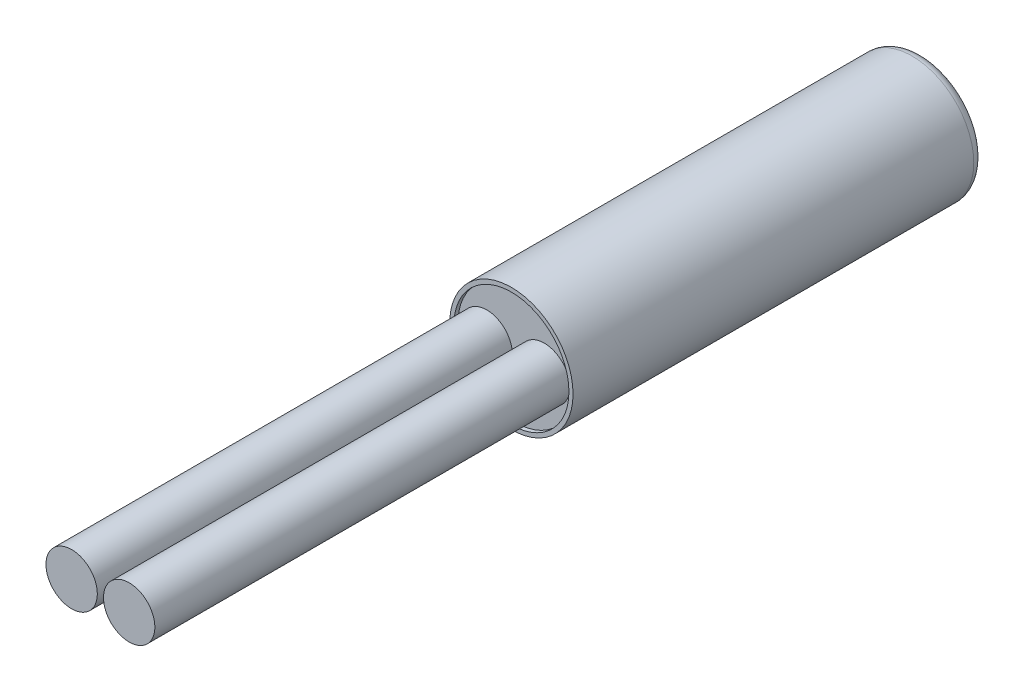
ISO-10303-21;
HEADER;
FILE_DESCRIPTION(('STEP AP214'),'2;1');
FILE_NAME('part.step','',(''),(''),'','','');
FILE_SCHEMA(('AUTOMOTIVE_DESIGN { 1 0 10303 214 1 1 1 1 }'));
ENDSEC;
DATA;
#1=APPLICATION_CONTEXT('core data for automotive mechanical design processes');
#2=APPLICATION_PROTOCOL_DEFINITION('international standard','automotive_design',2000,#1);
#3=PRODUCT_CONTEXT('',#1,'mechanical');
#4=PRODUCT('Part','Part','',(#3));
#5=PRODUCT_RELATED_PRODUCT_CATEGORY('part','',(#4));
#6=PRODUCT_DEFINITION_FORMATION('','',#4);
#7=PRODUCT_DEFINITION_CONTEXT('part definition',#1,'design');
#8=PRODUCT_DEFINITION('design','',#6,#7);
#9=PRODUCT_DEFINITION_SHAPE('','',#8);
#10=(LENGTH_UNIT() NAMED_UNIT(*) SI_UNIT(.MILLI.,.METRE.));
#11=(NAMED_UNIT(*) PLANE_ANGLE_UNIT() SI_UNIT($,.RADIAN.));
#12=(NAMED_UNIT(*) SI_UNIT($,.STERADIAN.) SOLID_ANGLE_UNIT());
#13=UNCERTAINTY_MEASURE_WITH_UNIT(LENGTH_MEASURE(1.E-05),#10,'distance_accuracy_value','');
#14=(GEOMETRIC_REPRESENTATION_CONTEXT(3) GLOBAL_UNCERTAINTY_ASSIGNED_CONTEXT((#13)) GLOBAL_UNIT_ASSIGNED_CONTEXT((#10,
#11,#12)) REPRESENTATION_CONTEXT('',''));
#15=CARTESIAN_POINT('',(0.,0.,0.));
#16=DIRECTION('',(0.,0.,1.));
#17=DIRECTION('',(1.,0.,0.));
#18=AXIS2_PLACEMENT_3D('',#15,#16,#17);
#19=CARTESIAN_POINT('',(0.,0.,20.));
#20=DIRECTION('',(0.,0.,-1.));
#21=DIRECTION('',(-1.,0.,0.));
#22=AXIS2_PLACEMENT_3D('',#19,#20,#21);
#23=CYLINDRICAL_SURFACE('',#22,3.);
#24=CARTESIAN_POINT('',(0.,0.,0.5));
#25=DIRECTION('',(0.,0.,1.));
#26=DIRECTION('',(1.,0.,0.));
#27=AXIS2_PLACEMENT_3D('',#24,#25,#26);
#28=CIRCLE('',#27,3.);
#29=CARTESIAN_POINT('',(3.,0.,0.5));
#30=VERTEX_POINT('',#29);
#31=EDGE_CURVE('E48',#30,#30,#28,.T.);
#32=ORIENTED_EDGE('',*,*,#31,.T.);
#33=EDGE_LOOP('',(#32));
#34=FACE_BOUND('',#33,.T.);
#35=CARTESIAN_POINT('',(0.,0.,20.));
#36=DIRECTION('',(0.,0.,1.));
#37=DIRECTION('',(1.,0.,0.));
#38=AXIS2_PLACEMENT_3D('',#35,#36,#37);
#39=CIRCLE('',#38,3.);
#40=CARTESIAN_POINT('',(3.,0.,20.));
#41=VERTEX_POINT('',#40);
#42=EDGE_CURVE('E52',#41,#41,#39,.T.);
#43=ORIENTED_EDGE('',*,*,#42,.F.);
#44=EDGE_LOOP('',(#43));
#45=FACE_BOUND('',#44,.T.);
#46=ADVANCED_FACE('F41',(#34,#45),#23,.T.);
#47=CARTESIAN_POINT('',(0.,0.,20.));
#48=DIRECTION('',(0.,0.,1.));
#49=DIRECTION('',(1.,0.,0.));
#50=AXIS2_PLACEMENT_3D('',#47,#48,#49);
#51=PLANE('',#50);
#52=CARTESIAN_POINT('',(0.,0.,20.));
#53=DIRECTION('',(0.,0.,1.));
#54=DIRECTION('',(1.,0.,0.));
#55=AXIS2_PLACEMENT_3D('',#52,#53,#54);
#56=CIRCLE('',#55,2.8);
#57=CARTESIAN_POINT('',(2.8,0.,20.));
#58=VERTEX_POINT('',#57);
#59=EDGE_CURVE('E59',#58,#58,#56,.T.);
#60=ORIENTED_EDGE('',*,*,#59,.F.);
#61=EDGE_LOOP('',(#60));
#62=FACE_BOUND('',#61,.T.);
#63=ORIENTED_EDGE('',*,*,#42,.T.);
#64=EDGE_LOOP('',(#63));
#65=FACE_BOUND('',#64,.T.);
#66=ADVANCED_FACE('F94',(#62,#65),#51,.T.);
#67=CARTESIAN_POINT('',(0.,0.,0.));
#68=DIRECTION('',(0.,0.,1.));
#69=DIRECTION('',(1.,0.,0.));
#70=AXIS2_PLACEMENT_3D('',#67,#68,#69);
#71=PLANE('',#70);
#72=CARTESIAN_POINT('',(0.,0.,0.));
#73=DIRECTION('',(0.,0.,1.));
#74=DIRECTION('',(1.,0.,0.));
#75=AXIS2_PLACEMENT_3D('',#72,#73,#74);
#76=CIRCLE('',#75,2.5);
#77=CARTESIAN_POINT('',(2.5,0.,0.));
#78=VERTEX_POINT('',#77);
#79=EDGE_CURVE('E10',#78,#78,#76,.F.);
#80=ORIENTED_EDGE('',*,*,#79,.T.);
#81=EDGE_LOOP('',(#80));
#82=FACE_BOUND('',#81,.T.);
#83=ADVANCED_FACE('F97',(#82),#71,.F.);
#84=CARTESIAN_POINT('',(0.,0.,0.5));
#85=DIRECTION('',(0.,0.,1.));
#86=DIRECTION('',(1.,0.,0.));
#87=AXIS2_PLACEMENT_3D('',#84,#85,#86);
#88=TOROIDAL_SURFACE('',#87,2.5,0.5);
#89=ORIENTED_EDGE('',*,*,#79,.F.);
#90=EDGE_LOOP('',(#89));
#91=FACE_BOUND('',#90,.T.);
#92=ORIENTED_EDGE('',*,*,#31,.F.);
#93=EDGE_LOOP('',(#92));
#94=FACE_BOUND('',#93,.T.);
#95=ADVANCED_FACE('F43',(#91,#94),#88,.T.);
#96=CARTESIAN_POINT('',(0.,0.,19.8));
#97=DIRECTION('',(0.,0.,1.));
#98=DIRECTION('',(1.,0.,0.));
#99=AXIS2_PLACEMENT_3D('',#96,#97,#98);
#100=CYLINDRICAL_SURFACE('',#99,2.8);
#101=CARTESIAN_POINT('',(0.,0.,19.8));
#102=DIRECTION('',(0.,0.,1.));
#103=DIRECTION('',(1.,0.,0.));
#104=AXIS2_PLACEMENT_3D('',#101,#102,#103);
#105=CIRCLE('',#104,2.8);
#106=CARTESIAN_POINT('',(2.8,0.,19.8));
#107=VERTEX_POINT('',#106);
#108=EDGE_CURVE('E56',#107,#107,#105,.T.);
#109=ORIENTED_EDGE('',*,*,#108,.F.);
#110=EDGE_LOOP('',(#109));
#111=FACE_BOUND('',#110,.T.);
#112=ORIENTED_EDGE('',*,*,#59,.T.);
#113=EDGE_LOOP('',(#112));
#114=FACE_BOUND('',#113,.T.);
#115=ADVANCED_FACE('F83',(#111,#114),#100,.F.);
#116=CARTESIAN_POINT('',(0.,0.,19.8));
#117=DIRECTION('',(0.,0.,1.));
#118=DIRECTION('',(1.,0.,0.));
#119=AXIS2_PLACEMENT_3D('',#116,#117,#118);
#120=PLANE('',#119);
#121=CARTESIAN_POINT('',(1.4,0.,19.8));
#122=DIRECTION('',(0.,0.,1.));
#123=DIRECTION('',(1.,0.,0.));
#124=AXIS2_PLACEMENT_3D('',#121,#122,#123);
#125=CIRCLE('',#124,1.25);
#126=CARTESIAN_POINT('',(2.65,0.,19.8));
#127=VERTEX_POINT('',#126);
#128=EDGE_CURVE('E68',#127,#127,#125,.T.);
#129=ORIENTED_EDGE('',*,*,#128,.F.);
#130=EDGE_LOOP('',(#129));
#131=FACE_BOUND('',#130,.T.);
#132=CARTESIAN_POINT('',(-1.4,0.,19.8));
#133=DIRECTION('',(0.,0.,1.));
#134=DIRECTION('',(1.,0.,0.));
#135=AXIS2_PLACEMENT_3D('',#132,#133,#134);
#136=CIRCLE('',#135,1.25);
#137=CARTESIAN_POINT('',(-0.15,0.,19.8));
#138=VERTEX_POINT('',#137);
#139=EDGE_CURVE('E65',#138,#138,#136,.T.);
#140=ORIENTED_EDGE('',*,*,#139,.F.);
#141=EDGE_LOOP('',(#140));
#142=FACE_BOUND('',#141,.T.);
#143=ORIENTED_EDGE('',*,*,#108,.T.);
#144=EDGE_LOOP('',(#143));
#145=FACE_BOUND('',#144,.T.);
#146=ADVANCED_FACE('F79',(#131,#142,#145),#120,.T.);
#147=CARTESIAN_POINT('',(-1.4,0.,40.));
#148=DIRECTION('',(0.,0.,-1.));
#149=DIRECTION('',(-1.,0.,0.));
#150=AXIS2_PLACEMENT_3D('',#147,#148,#149);
#151=CYLINDRICAL_SURFACE('',#150,1.25);
#152=CARTESIAN_POINT('',(-1.4,0.,40.));
#153=DIRECTION('',(0.,0.,1.));
#154=DIRECTION('',(1.,0.,0.));
#155=AXIS2_PLACEMENT_3D('',#152,#153,#154);
#156=CIRCLE('',#155,1.25);
#157=CARTESIAN_POINT('',(-0.15,0.,40.));
#158=VERTEX_POINT('',#157);
#159=EDGE_CURVE('E62',#158,#158,#156,.T.);
#160=ORIENTED_EDGE('',*,*,#159,.F.);
#161=EDGE_LOOP('',(#160));
#162=FACE_BOUND('',#161,.T.);
#163=ORIENTED_EDGE('',*,*,#139,.T.);
#164=EDGE_LOOP('',(#163));
#165=FACE_BOUND('',#164,.T.);
#166=ADVANCED_FACE('F82',(#162,#165),#151,.T.);
#167=CARTESIAN_POINT('',(-1.4,0.,40.));
#168=DIRECTION('',(0.,0.,1.));
#169=DIRECTION('',(1.,0.,0.));
#170=AXIS2_PLACEMENT_3D('',#167,#168,#169);
#171=PLANE('',#170);
#172=ORIENTED_EDGE('',*,*,#159,.T.);
#173=EDGE_LOOP('',(#172));
#174=FACE_BOUND('',#173,.T.);
#175=ADVANCED_FACE('F109',(#174),#171,.T.);
#176=CARTESIAN_POINT('',(1.4,0.,40.));
#177=DIRECTION('',(0.,0.,-1.));
#178=DIRECTION('',(-1.,0.,0.));
#179=AXIS2_PLACEMENT_3D('',#176,#177,#178);
#180=CYLINDRICAL_SURFACE('',#179,1.25);
#181=CARTESIAN_POINT('',(1.4,0.,40.));
#182=DIRECTION('',(0.,0.,1.));
#183=DIRECTION('',(1.,0.,0.));
#184=AXIS2_PLACEMENT_3D('',#181,#182,#183);
#185=CIRCLE('',#184,1.25);
#186=CARTESIAN_POINT('',(2.65,0.,40.));
#187=VERTEX_POINT('',#186);
#188=EDGE_CURVE('E71',#187,#187,#185,.T.);
#189=ORIENTED_EDGE('',*,*,#188,.F.);
#190=EDGE_LOOP('',(#189));
#191=FACE_BOUND('',#190,.T.);
#192=ORIENTED_EDGE('',*,*,#128,.T.);
#193=EDGE_LOOP('',(#192));
#194=FACE_BOUND('',#193,.T.);
#195=ADVANCED_FACE('F77',(#191,#194),#180,.T.);
#196=CARTESIAN_POINT('',(1.4,0.,40.));
#197=DIRECTION('',(0.,0.,1.));
#198=DIRECTION('',(1.,0.,0.));
#199=AXIS2_PLACEMENT_3D('',#196,#197,#198);
#200=PLANE('',#199);
#201=ORIENTED_EDGE('',*,*,#188,.T.);
#202=EDGE_LOOP('',(#201));
#203=FACE_BOUND('',#202,.T.);
#204=ADVANCED_FACE('F114',(#203),#200,.T.);
#205=CLOSED_SHELL('',(#46,#66,#83,#95,#115,#146,#166,#175,#195,#204));
#206=MANIFOLD_SOLID_BREP('B2',#205);
#207=ADVANCED_BREP_SHAPE_REPRESENTATION('',(#18,#206),#14);
#208=SHAPE_DEFINITION_REPRESENTATION(#9,#207);
ENDSEC;
END-ISO-10303-21;
